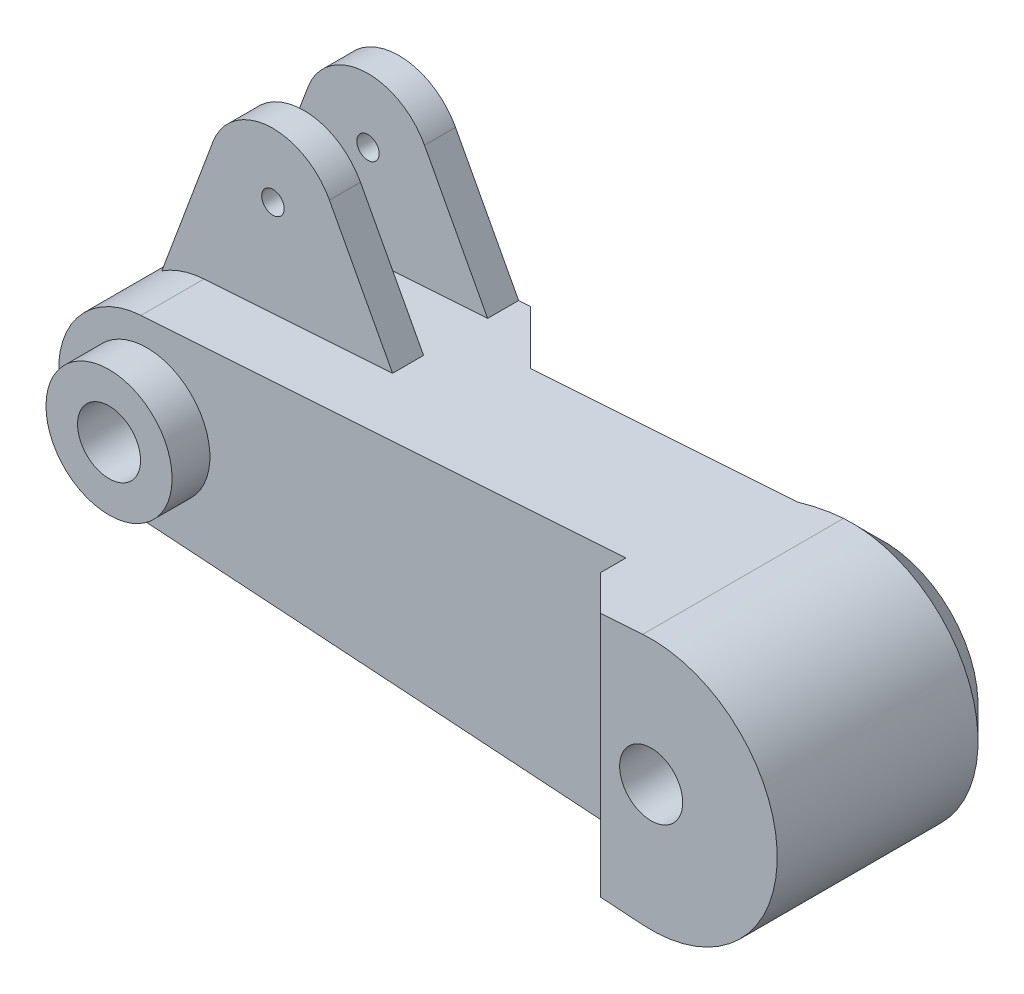
ISO-10303-21;
HEADER;
FILE_DESCRIPTION(('STEP AP214'),'2;1');
FILE_NAME('part.step','',(''),(''),'','','');
FILE_SCHEMA(('AUTOMOTIVE_DESIGN { 1 0 10303 214 1 1 1 1 }'));
ENDSEC;
DATA;
#1=APPLICATION_CONTEXT('core data for automotive mechanical design processes');
#2=APPLICATION_PROTOCOL_DEFINITION('international standard','automotive_design',2000,#1);
#3=PRODUCT_CONTEXT('',#1,'mechanical');
#4=PRODUCT('Part','Part','',(#3));
#5=PRODUCT_RELATED_PRODUCT_CATEGORY('part','',(#4));
#6=PRODUCT_DEFINITION_FORMATION('','',#4);
#7=PRODUCT_DEFINITION_CONTEXT('part definition',#1,'design');
#8=PRODUCT_DEFINITION('design','',#6,#7);
#9=PRODUCT_DEFINITION_SHAPE('','',#8);
#10=(LENGTH_UNIT() NAMED_UNIT(*) SI_UNIT(.MILLI.,.METRE.));
#11=(NAMED_UNIT(*) PLANE_ANGLE_UNIT() SI_UNIT($,.RADIAN.));
#12=(NAMED_UNIT(*) SI_UNIT($,.STERADIAN.) SOLID_ANGLE_UNIT());
#13=UNCERTAINTY_MEASURE_WITH_UNIT(LENGTH_MEASURE(1.E-05),#10,'distance_accuracy_value','');
#14=(GEOMETRIC_REPRESENTATION_CONTEXT(3) GLOBAL_UNCERTAINTY_ASSIGNED_CONTEXT((#13)) GLOBAL_UNIT_ASSIGNED_CONTEXT((#10,
#11,#12)) REPRESENTATION_CONTEXT('',''));
#15=CARTESIAN_POINT('',(0.,0.,0.));
#16=DIRECTION('',(0.,0.,1.));
#17=DIRECTION('',(1.,0.,0.));
#18=AXIS2_PLACEMENT_3D('',#15,#16,#17);
#19=CARTESIAN_POINT('',(-52.,-10.,15.));
#20=DIRECTION('',(0.,0.,-1.));
#21=DIRECTION('',(-1.,0.,0.));
#22=AXIS2_PLACEMENT_3D('',#19,#20,#21);
#23=PLANE('',#22);
#24=CARTESIAN_POINT('',(-45.,0.,15.));
#25=DIRECTION('',(0.,0.,-1.));
#26=DIRECTION('',(-1.,0.,0.));
#27=AXIS2_PLACEMENT_3D('',#24,#25,#26);
#28=CIRCLE('',#27,7.);
#29=CARTESIAN_POINT('',(-45.4666666666667,-6.98442712197802,15.));
#30=VERTEX_POINT('',#29);
#31=CARTESIAN_POINT('',(-45.4666666666667,6.98442712197802,15.));
#32=VERTEX_POINT('',#31);
#33=EDGE_CURVE('E194',#30,#32,#28,.T.);
#34=ORIENTED_EDGE('',*,*,#33,.F.);
#35=DIRECTION('',(-0.997775303139718,0.0666666666666667,0.));
#36=VECTOR('',#35,1.);
#37=CARTESIAN_POINT('',(-45.4666666666667,-6.98442712197802,15.));
#38=LINE('',#37,#36);
#39=CARTESIAN_POINT('',(-7.00000000000001,-9.55458939836917,15.));
#40=VERTEX_POINT('',#39);
#41=EDGE_CURVE('E177',#40,#30,#38,.T.);
#42=ORIENTED_EDGE('',*,*,#41,.F.);
#43=DIRECTION('',(0.,1.,0.));
#44=VECTOR('',#43,1.);
#45=CARTESIAN_POINT('',(-7.00000000000001,-10.,15.));
#46=LINE('',#45,#44);
#47=CARTESIAN_POINT('',(-7.00000000000001,9.55458939836917,15.));
#48=VERTEX_POINT('',#47);
#49=EDGE_CURVE('E191',#40,#48,#46,.T.);
#50=ORIENTED_EDGE('',*,*,#49,.T.);
#51=DIRECTION('',(0.997775303139718,0.0666666666666668,0.));
#52=VECTOR('',#51,1.);
#53=CARTESIAN_POINT('',(-45.4666666666667,6.98442712197802,15.));
#54=LINE('',#53,#52);
#55=EDGE_CURVE('E206',#32,#48,#54,.T.);
#56=ORIENTED_EDGE('',*,*,#55,.F.);
#57=EDGE_LOOP('',(#34,#42,#50,#56));
#58=FACE_BOUND('',#57,.T.);
#59=CARTESIAN_POINT('',(-45.,0.,15.));
#60=DIRECTION('',(0.,0.,-1.));
#61=DIRECTION('',(-1.,0.,0.));
#62=AXIS2_PLACEMENT_3D('',#59,#60,#61);
#63=CIRCLE('',#62,5.);
#64=CARTESIAN_POINT('',(-50.,0.,15.));
#65=VERTEX_POINT('',#64);
#66=EDGE_CURVE('E325',#65,#65,#63,.F.);
#67=ORIENTED_EDGE('',*,*,#66,.F.);
#68=EDGE_LOOP('',(#67));
#69=FACE_BOUND('',#68,.T.);
#70=ADVANCED_FACE('F40',(#58,#69),#23,.F.);
#71=CARTESIAN_POINT('',(-30.,-10.,4.572));
#72=DIRECTION('',(0.,0.,1.));
#73=DIRECTION('',(1.,0.,0.));
#74=AXIS2_PLACEMENT_3D('',#71,#72,#73);
#75=PLANE('',#74);
#76=DIRECTION('',(-0.997775303139718,-0.0666666666666668,0.));
#77=VECTOR('',#76,1.);
#78=CARTESIAN_POINT('',(-45.4666666666667,6.98442712197802,4.572));
#79=LINE('',#78,#77);
#80=CARTESIAN_POINT('',(-3.86110628018951,9.76431555681609,4.572));
#81=VERTEX_POINT('',#80);
#82=CARTESIAN_POINT('',(-24.9999999999999,8.35191380976327,4.572));
#83=VERTEX_POINT('',#82);
#84=EDGE_CURVE('E186',#81,#83,#79,.T.);
#85=ORIENTED_EDGE('',*,*,#84,.F.);
#86=CARTESIAN_POINT('',(0.,0.,4.572));
#87=DIRECTION('',(0.,0.,1.));
#88=DIRECTION('',(1.,0.,0.));
#89=AXIS2_PLACEMENT_3D('',#86,#87,#88);
#90=CIRCLE('',#89,10.5);
#91=CARTESIAN_POINT('',(-3.86110628018952,-9.76431555681609,4.572));
#92=VERTEX_POINT('',#91);
#93=EDGE_CURVE('E335',#81,#92,#90,.T.);
#94=ORIENTED_EDGE('',*,*,#93,.T.);
#95=DIRECTION('',(0.997775303139718,-0.0666666666666667,0.));
#96=VECTOR('',#95,1.);
#97=CARTESIAN_POINT('',(-45.4666666666667,-6.98442712197802,4.572));
#98=LINE('',#97,#96);
#99=CARTESIAN_POINT('',(-24.9999999999999,-8.35191380976327,4.572));
#100=VERTEX_POINT('',#99);
#101=EDGE_CURVE('E208',#100,#92,#98,.T.);
#102=ORIENTED_EDGE('',*,*,#101,.F.);
#103=DIRECTION('',(0.,1.,0.));
#104=VECTOR('',#103,1.);
#105=CARTESIAN_POINT('',(-24.9999999999999,8.01783725737273,4.572));
#106=LINE('',#105,#104);
#107=EDGE_CURVE('E312',#100,#83,#106,.T.);
#108=ORIENTED_EDGE('',*,*,#107,.T.);
#109=EDGE_LOOP('',(#85,#94,#102,#108));
#110=FACE_BOUND('',#109,.T.);
#111=ADVANCED_FACE('F378',(#110),#75,.F.);
#112=CARTESIAN_POINT('',(-30.5120222717425,7.98362633031455,10.));
#113=DIRECTION('',(-0.882521204850308,-0.470272604974562,0.));
#114=DIRECTION('',(0.470272604974562,-0.882521204850308,0.));
#115=AXIS2_PLACEMENT_3D('',#112,#113,#114);
#116=PLANE('',#115);
#117=DIRECTION('',(0.,0.,-1.));
#118=VECTOR('',#117,1.);
#119=CARTESIAN_POINT('',(-30.5120222717425,7.98362633031455,10.));
#120=LINE('',#119,#118);
#121=CARTESIAN_POINT('',(-30.5120222717425,7.98362633031455,10.));
#122=VERTEX_POINT('',#121);
#123=CARTESIAN_POINT('',(-30.5120222717425,7.98362633031455,7.54));
#124=VERTEX_POINT('',#123);
#125=EDGE_CURVE('E272',#122,#124,#120,.T.);
#126=ORIENTED_EDGE('',*,*,#125,.T.);
#127=DIRECTION('',(-0.470272604974562,0.882521204850308,0.));
#128=VECTOR('',#127,1.);
#129=CARTESIAN_POINT('',(-30.5120222717425,7.98362633031455,7.54));
#130=LINE('',#129,#128);
#131=CARTESIAN_POINT('',(-35.5167922793604,17.37565897351,7.54));
#132=VERTEX_POINT('',#131);
#133=EDGE_CURVE('E237',#124,#132,#130,.T.);
#134=ORIENTED_EDGE('',*,*,#133,.T.);
#135=DIRECTION('',(0.,0.,-1.));
#136=VECTOR('',#135,1.);
#137=CARTESIAN_POINT('',(-35.5167922793604,17.37565897351,10.));
#138=LINE('',#137,#136);
#139=CARTESIAN_POINT('',(-35.5167922793604,17.37565897351,10.));
#140=VERTEX_POINT('',#139);
#141=EDGE_CURVE('E268',#140,#132,#138,.T.);
#142=ORIENTED_EDGE('',*,*,#141,.F.);
#143=DIRECTION('',(-0.470272604974562,0.882521204850308,0.));
#144=VECTOR('',#143,1.);
#145=CARTESIAN_POINT('',(-30.5120222717425,7.98362633031455,10.));
#146=LINE('',#145,#144);
#147=EDGE_CURVE('E251',#122,#140,#146,.T.);
#148=ORIENTED_EDGE('',*,*,#147,.F.);
#149=EDGE_LOOP('',(#126,#134,#142,#148));
#150=FACE_BOUND('',#149,.T.);
#151=ADVANCED_FACE('F383',(#150),#116,.F.);
#152=CARTESIAN_POINT('',(-40.,14.9866741402392,10.));
#153=DIRECTION('',(0.,0.,-1.));
#154=DIRECTION('',(-1.,0.,0.));
#155=AXIS2_PLACEMENT_3D('',#152,#153,#154);
#156=CYLINDRICAL_SURFACE('',#155,5.08);
#157=ORIENTED_EDGE('',*,*,#141,.T.);
#158=CARTESIAN_POINT('',(-40.,14.9866741402392,7.54));
#159=DIRECTION('',(0.,0.,1.));
#160=DIRECTION('',(0.,-1.,0.));
#161=AXIS2_PLACEMENT_3D('',#158,#159,#160);
#162=CIRCLE('',#161,5.08);
#163=CARTESIAN_POINT('',(-44.76117966084,16.7579923604365,7.54));
#164=VERTEX_POINT('',#163);
#165=EDGE_CURVE('E234',#132,#164,#162,.T.);
#166=ORIENTED_EDGE('',*,*,#165,.T.);
#167=DIRECTION('',(0.,0.,-1.));
#168=VECTOR('',#167,1.);
#169=CARTESIAN_POINT('',(-44.76117966084,16.7579923604365,10.));
#170=LINE('',#169,#168);
#171=CARTESIAN_POINT('',(-44.76117966084,16.7579923604365,10.));
#172=VERTEX_POINT('',#171);
#173=EDGE_CURVE('E264',#172,#164,#170,.T.);
#174=ORIENTED_EDGE('',*,*,#173,.F.);
#175=CARTESIAN_POINT('',(-40.,14.9866741402392,10.));
#176=DIRECTION('',(0.,0.,1.));
#177=DIRECTION('',(1.,0.,0.));
#178=AXIS2_PLACEMENT_3D('',#175,#176,#177);
#179=CIRCLE('',#178,5.08);
#180=EDGE_CURVE('E253',#140,#172,#179,.T.);
#181=ORIENTED_EDGE('',*,*,#180,.F.);
#182=EDGE_LOOP('',(#157,#166,#174,#181));
#183=FACE_BOUND('',#182,.T.);
#184=ADVANCED_FACE('F353',(#183),#156,.T.);
#185=CARTESIAN_POINT('',(-45.,0.,20.));
#186=DIRECTION('',(0.,0.,-1.));
#187=DIRECTION('',(-1.,0.,0.));
#188=AXIS2_PLACEMENT_3D('',#185,#186,#187);
#189=CYLINDRICAL_SURFACE('',#188,7.);
#190=DIRECTION('',(0.,0.,-1.));
#191=VECTOR('',#190,1.);
#192=CARTESIAN_POINT('',(-45.4666666666667,-6.98442712197802,20.));
#193=LINE('',#192,#191);
#194=CARTESIAN_POINT('',(-45.4666666666667,-6.98442712197802,0.));
#195=VERTEX_POINT('',#194);
#196=EDGE_CURVE('E301',#30,#195,#193,.T.);
#197=ORIENTED_EDGE('',*,*,#196,.F.);
#198=ORIENTED_EDGE('',*,*,#33,.T.);
#199=DIRECTION('',(0.,0.,-1.));
#200=VECTOR('',#199,1.);
#201=CARTESIAN_POINT('',(-45.4666666666667,6.98442712197802,20.));
#202=LINE('',#201,#200);
#203=CARTESIAN_POINT('',(-45.4666666666667,6.98442712197802,10.));
#204=VERTEX_POINT('',#203);
#205=EDGE_CURVE('E292',#32,#204,#202,.T.);
#206=ORIENTED_EDGE('',*,*,#205,.T.);
#207=CARTESIAN_POINT('',(-45.,0.,10.));
#208=DIRECTION('',(0.,0.,-1.));
#209=DIRECTION('',(1.,0.,0.));
#210=AXIS2_PLACEMENT_3D('',#207,#208,#209);
#211=CIRCLE('',#210,7.);
#212=CARTESIAN_POINT('',(-48.8113471061586,5.87142514525872,10.));
#213=VERTEX_POINT('',#212);
#214=EDGE_CURVE('E244',#213,#204,#211,.T.);
#215=ORIENTED_EDGE('',*,*,#214,.F.);
#216=DIRECTION('',(0.,0.,-1.));
#217=VECTOR('',#216,1.);
#218=CARTESIAN_POINT('',(-48.8113471061586,5.87142514525872,10.));
#219=LINE('',#218,#217);
#220=CARTESIAN_POINT('',(-48.8113471061586,5.87142514525872,0.));
#221=VERTEX_POINT('',#220);
#222=EDGE_CURVE('E275',#213,#221,#219,.T.);
#223=ORIENTED_EDGE('',*,*,#222,.T.);
#224=CARTESIAN_POINT('',(-45.,0.,0.));
#225=DIRECTION('',(0.,0.,1.));
#226=DIRECTION('',(1.,0.,0.));
#227=AXIS2_PLACEMENT_3D('',#224,#225,#226);
#228=CIRCLE('',#227,7.);
#229=EDGE_CURVE('E281',#221,#195,#228,.T.);
#230=ORIENTED_EDGE('',*,*,#229,.T.);
#231=EDGE_LOOP('',(#197,#198,#206,#215,#223,#230));
#232=FACE_BOUND('',#231,.T.);
#233=ADVANCED_FACE('F350',(#232),#189,.T.);
#234=CARTESIAN_POINT('',(-45.4666666666667,6.98442712197802,20.));
#235=DIRECTION('',(0.0666666666666668,-0.997775303139718,0.));
#236=DIRECTION('',(0.997775303139718,0.0666666666666668,0.));
#237=AXIS2_PLACEMENT_3D('',#234,#235,#236);
#238=PLANE('',#237);
#239=DIRECTION('',(0.,0.,1.));
#240=VECTOR('',#239,1.);
#241=CARTESIAN_POINT('',(-7.00000000000001,9.55458939836917,20.));
#242=LINE('',#241,#240);
#243=CARTESIAN_POINT('',(-7.00000000000001,9.55458939836917,17.));
#244=VERTEX_POINT('',#243);
#245=EDGE_CURVE('E185',#48,#244,#242,.T.);
#246=ORIENTED_EDGE('',*,*,#245,.T.);
#247=DIRECTION('',(0.706318918233046,0.0471929178183011,0.706318918233042));
#248=VECTOR('',#247,1.);
#249=CARTESIAN_POINT('',(-7.65181803000214,9.51103797431936,16.3481819699979));
#250=LINE('',#249,#248);
#251=CARTESIAN_POINT('',(-4.,9.75503532980349,20.));
#252=VERTEX_POINT('',#251);
#253=EDGE_CURVE('E330',#244,#252,#250,.T.);
#254=ORIENTED_EDGE('',*,*,#253,.T.);
#255=DIRECTION('',(-0.997775303139718,-0.0666666666666668,0.));
#256=VECTOR('',#255,1.);
#257=CARTESIAN_POINT('',(-45.4666666666667,6.98442712197802,20.));
#258=LINE('',#257,#256);
#259=CARTESIAN_POINT('',(-0.666666666666665,9.97775303139718,20.));
#260=VERTEX_POINT('',#259);
#261=EDGE_CURVE('E289',#260,#252,#258,.T.);
#262=ORIENTED_EDGE('',*,*,#261,.F.);
#263=DIRECTION('',(0.,0.,-1.));
#264=VECTOR('',#263,1.);
#265=CARTESIAN_POINT('',(-0.666666666666665,9.97775303139718,20.));
#266=LINE('',#265,#264);
#267=CARTESIAN_POINT('',(-0.666666666666665,9.97775303139718,4.07200000000002));
#268=VERTEX_POINT('',#267);
#269=EDGE_CURVE('E61',#260,#268,#266,.T.);
#270=ORIENTED_EDGE('',*,*,#269,.T.);
#271=CARTESIAN_POINT('',(-0.666666666666665,9.97775303139718,4.07200000000002));
#272=CARTESIAN_POINT('',(-0.802311553116537,9.96868987619427,4.07199227718591));
#273=CARTESIAN_POINT('',(-0.93794176782531,9.95962770128829,4.07477330544112));
#274=CARTESIAN_POINT('',(-1.20896713377436,9.94151905731496,4.08584129678912));
#275=CARTESIAN_POINT('',(-1.3443623041731,9.93247258696753,4.09412778775187));
#276=CARTESIAN_POINT('',(-1.74837955702386,9.9054780487798,4.12701332720823));
#277=CARTESIAN_POINT('',(-2.01638495367758,9.88757118499257,4.15964033469788));
#278=CARTESIAN_POINT('',(-2.54901139088242,9.85198358422188,4.24498320746917));
#279=CARTESIAN_POINT('',(-2.81363397676884,9.83430274398636,4.29768953452867));
#280=CARTESIAN_POINT('',(-3.20806670748223,9.80794859862102,4.39047792022871));
#281=CARTESIAN_POINT('',(-3.33950015565084,9.79916683197442,4.42381086255465));
#282=CARTESIAN_POINT('',(-3.60119329245134,9.78168172378911,4.49476147246656));
#283=CARTESIAN_POINT('',(-3.73145313487216,9.77297837197493,4.53237856957991));
#284=CARTESIAN_POINT('',(-3.86110628018951,9.76431555681609,4.572));
#285=B_SPLINE_CURVE_WITH_KNOTS('',3,(#271,#272,#273,#274,#275,#276,#277,#278,#279,#280,#281,
#282,#283,#284),.UNSPECIFIED.,.F.,.F.,(4,2,2,2,2,2,4),(0.,0.407785235213258,0.815535504643655,
1.62638482378702,2.43684944679052,2.84442266241533,3.25194166942249),.UNSPECIFIED.);
#286=EDGE_CURVE('E11',#268,#81,#285,.T.);
#287=ORIENTED_EDGE('',*,*,#286,.T.);
#288=ORIENTED_EDGE('',*,*,#84,.T.);
#289=DIRECTION('',(0.706318918233048,0.0471929178183012,0.70631891823304));
#290=VECTOR('',#289,1.);
#291=CARTESIAN_POINT('',(-27.5593051224945,8.18091304339559,2.01269487750544));
#292=LINE('',#291,#290);
#293=CARTESIAN_POINT('',(-29.572,8.04643421025736,0.));
#294=VERTEX_POINT('',#293);
#295=EDGE_CURVE('E317',#83,#294,#292,.F.);
#296=ORIENTED_EDGE('',*,*,#295,.T.);
#297=DIRECTION('',(-0.997775303139718,-0.0666666666666668,0.));
#298=VECTOR('',#297,1.);
#299=CARTESIAN_POINT('',(-45.4666666666667,6.98442712197802,0.));
#300=LINE('',#299,#298);
#301=CARTESIAN_POINT('',(-30.5120222717425,7.98362633031455,0.));
#302=VERTEX_POINT('',#301);
#303=EDGE_CURVE('E287',#294,#302,#300,.T.);
#304=ORIENTED_EDGE('',*,*,#303,.T.);
#305=CARTESIAN_POINT('',(-30.5120222717425,7.98362633031455,2.46));
#306=VERTEX_POINT('',#305);
#307=EDGE_CURVE('E271',#306,#302,#120,.T.);
#308=ORIENTED_EDGE('',*,*,#307,.F.);
#309=DIRECTION('',(0.997775303139718,0.0666666666666668,0.));
#310=VECTOR('',#309,1.);
#311=CARTESIAN_POINT('',(-53.100739090982,6.47435420273504,2.46));
#312=LINE('',#311,#310);
#313=CARTESIAN_POINT('',(-48.4719777282574,6.78362633031454,2.46));
#314=VERTEX_POINT('',#313);
#315=EDGE_CURVE('E224',#314,#306,#312,.T.);
#316=ORIENTED_EDGE('',*,*,#315,.F.);
#317=DIRECTION('',(0.,0.,-1.));
#318=VECTOR('',#317,1.);
#319=CARTESIAN_POINT('',(-48.4719777282574,6.78362633031454,10.));
#320=LINE('',#319,#318);
#321=CARTESIAN_POINT('',(-48.4719777282574,6.78362633031454,7.54));
#322=VERTEX_POINT('',#321);
#323=EDGE_CURVE('E303',#322,#314,#320,.T.);
#324=ORIENTED_EDGE('',*,*,#323,.F.);
#325=DIRECTION('',(0.997775303139718,0.0666666666666668,0.));
#326=VECTOR('',#325,1.);
#327=CARTESIAN_POINT('',(-53.100739090982,6.47435420273504,7.54));
#328=LINE('',#327,#326);
#329=EDGE_CURVE('E223',#322,#124,#328,.T.);
#330=ORIENTED_EDGE('',*,*,#329,.T.);
#331=ORIENTED_EDGE('',*,*,#125,.F.);
#332=DIRECTION('',(0.997775303139718,0.0666666666666665,0.));
#333=VECTOR('',#332,1.);
#334=CARTESIAN_POINT('',(-45.4666666666667,6.98442712197803,10.));
#335=LINE('',#334,#333);
#336=EDGE_CURVE('E248',#204,#122,#335,.T.);
#337=ORIENTED_EDGE('',*,*,#336,.F.);
#338=ORIENTED_EDGE('',*,*,#205,.F.);
#339=ORIENTED_EDGE('',*,*,#55,.T.);
#340=EDGE_LOOP('',(#246,#254,#262,#270,#287,#288,#296,#304,#308,#316,#324,#330,#331,#337,#338,#339));
#341=FACE_BOUND('',#340,.T.);
#342=ADVANCED_FACE('F349',(#341),#238,.F.);
#343=CARTESIAN_POINT('',(-45.4666666666667,-6.98442712197802,20.));
#344=DIRECTION('',(0.0666666666666667,0.997775303139718,0.));
#345=DIRECTION('',(-0.997775303139718,0.0666666666666667,0.));
#346=AXIS2_PLACEMENT_3D('',#343,#344,#345);
#347=PLANE('',#346);
#348=DIRECTION('',(0.997775303139718,-0.0666666666666667,0.));
#349=VECTOR('',#348,1.);
#350=CARTESIAN_POINT('',(-45.4666666666667,-6.98442712197802,20.));
#351=LINE('',#350,#349);
#352=CARTESIAN_POINT('',(-4.,-9.75503532980349,20.));
#353=VERTEX_POINT('',#352);
#354=CARTESIAN_POINT('',(-0.666666666666666,-9.97775303139718,20.));
#355=VERTEX_POINT('',#354);
#356=EDGE_CURVE('E284',#353,#355,#351,.T.);
#357=ORIENTED_EDGE('',*,*,#356,.F.);
#358=DIRECTION('',(-0.706318918233046,0.047192917818301,-0.706318918233042));
#359=VECTOR('',#358,1.);
#360=CARTESIAN_POINT('',(-6.98515301676847,-9.55558140416345,17.0148469832315));
#361=LINE('',#360,#359);
#362=CARTESIAN_POINT('',(-7.00000000000001,-9.55458939836917,17.));
#363=VERTEX_POINT('',#362);
#364=EDGE_CURVE('E180',#353,#363,#361,.T.);
#365=ORIENTED_EDGE('',*,*,#364,.T.);
#366=DIRECTION('',(0.,0.,-1.));
#367=VECTOR('',#366,1.);
#368=CARTESIAN_POINT('',(-7.00000000000001,-9.55458939836917,20.));
#369=LINE('',#368,#367);
#370=EDGE_CURVE('E173',#363,#40,#369,.T.);
#371=ORIENTED_EDGE('',*,*,#370,.T.);
#372=ORIENTED_EDGE('',*,*,#41,.T.);
#373=ORIENTED_EDGE('',*,*,#196,.T.);
#374=DIRECTION('',(0.997775303139718,-0.0666666666666667,0.));
#375=VECTOR('',#374,1.);
#376=CARTESIAN_POINT('',(-45.4666666666667,-6.98442712197802,0.));
#377=LINE('',#376,#375);
#378=CARTESIAN_POINT('',(-29.572,-8.04643421025736,0.));
#379=VERTEX_POINT('',#378);
#380=EDGE_CURVE('E295',#195,#379,#377,.T.);
#381=ORIENTED_EDGE('',*,*,#380,.T.);
#382=DIRECTION('',(-0.706318918233048,0.0471929178183011,-0.70631891823304));
#383=VECTOR('',#382,1.);
#384=CARTESIAN_POINT('',(-27.5593051224945,-8.18091304339559,2.01269487750544));
#385=LINE('',#384,#383);
#386=EDGE_CURVE('E323',#379,#100,#385,.F.);
#387=ORIENTED_EDGE('',*,*,#386,.T.);
#388=ORIENTED_EDGE('',*,*,#101,.T.);
#389=CARTESIAN_POINT('',(-3.86110628018952,-9.76431555681609,4.572));
#390=CARTESIAN_POINT('',(-3.73145313487217,-9.77297837197493,4.53237856957991));
#391=CARTESIAN_POINT('',(-3.60119329245134,-9.78168172378911,4.49476147246656));
#392=CARTESIAN_POINT('',(-3.33950015565085,-9.79916683197442,4.42381086255465));
#393=CARTESIAN_POINT('',(-3.20806670748223,-9.80794859862102,4.39047792022871));
#394=CARTESIAN_POINT('',(-2.81363397676884,-9.83430274398636,4.29768953452867));
#395=CARTESIAN_POINT('',(-2.54901139088243,-9.85198358422188,4.24498320746917));
#396=CARTESIAN_POINT('',(-2.01638495367758,-9.88757118499257,4.15964033469787));
#397=CARTESIAN_POINT('',(-1.74837955702386,-9.90547804877979,4.12701332720822));
#398=CARTESIAN_POINT('',(-1.3443623041731,-9.93247258696753,4.09412778775186));
#399=CARTESIAN_POINT('',(-1.20896713377436,-9.94151905731496,4.08584129678911));
#400=CARTESIAN_POINT('',(-0.937941767825311,-9.95962770128828,4.07477330544111));
#401=CARTESIAN_POINT('',(-0.802311553116538,-9.96868987619426,4.07199227718591));
#402=CARTESIAN_POINT('',(-0.666666666666665,-9.97775303139718,4.07200000000002));
#403=B_SPLINE_CURVE_WITH_KNOTS('',3,(#389,#390,#391,#392,#393,#394,#395,#396,#397,#398,#399,
#400,#401,#402),.UNSPECIFIED.,.F.,.F.,(4,2,2,2,2,2,4),(0.,0.407519007007159,0.815092222631966,
1.62555684563547,2.43640616477884,2.84415643420924,3.2519416694225),.UNSPECIFIED.);
#404=CARTESIAN_POINT('',(-0.666666666666666,-9.97775303139718,4.07200000000002));
#405=VERTEX_POINT('',#404);
#406=EDGE_CURVE('E338',#92,#405,#403,.T.);
#407=ORIENTED_EDGE('',*,*,#406,.T.);
#408=DIRECTION('',(0.,0.,-1.));
#409=VECTOR('',#408,1.);
#410=CARTESIAN_POINT('',(-0.666666666666666,-9.97775303139718,20.));
#411=LINE('',#410,#409);
#412=EDGE_CURVE('E68',#355,#405,#411,.T.);
#413=ORIENTED_EDGE('',*,*,#412,.F.);
#414=EDGE_LOOP('',(#357,#365,#371,#372,#373,#381,#387,#388,#407,#413));
#415=FACE_BOUND('',#414,.T.);
#416=ADVANCED_FACE('F176',(#415),#347,.F.);
#417=CARTESIAN_POINT('',(0.,0.,20.));
#418=DIRECTION('',(0.,0.,-1.));
#419=DIRECTION('',(-1.,0.,0.));
#420=AXIS2_PLACEMENT_3D('',#417,#418,#419);
#421=CYLINDRICAL_SURFACE('',#420,10.);
#422=ORIENTED_EDGE('',*,*,#412,.T.);
#423=CARTESIAN_POINT('',(0.,0.,4.07200000000002));
#424=DIRECTION('',(0.,0.,1.));
#425=DIRECTION('',(1.,0.,0.));
#426=AXIS2_PLACEMENT_3D('',#423,#424,#425);
#427=CIRCLE('',#426,10.);
#428=EDGE_CURVE('E55',#405,#268,#427,.T.);
#429=ORIENTED_EDGE('',*,*,#428,.T.);
#430=ORIENTED_EDGE('',*,*,#269,.F.);
#431=CARTESIAN_POINT('',(0.,0.,20.));
#432=DIRECTION('',(0.,0.,1.));
#433=DIRECTION('',(1.,0.,0.));
#434=AXIS2_PLACEMENT_3D('',#431,#432,#433);
#435=CIRCLE('',#434,10.);
#436=EDGE_CURVE('E286',#355,#260,#435,.T.);
#437=ORIENTED_EDGE('',*,*,#436,.F.);
#438=EDGE_LOOP('',(#422,#429,#430,#437));
#439=FACE_BOUND('',#438,.T.);
#440=ADVANCED_FACE('F348',(#439),#421,.T.);
#441=CARTESIAN_POINT('',(-45.,0.,20.));
#442=DIRECTION('',(0.,0.,1.));
#443=DIRECTION('',(1.,0.,0.));
#444=AXIS2_PLACEMENT_3D('',#441,#442,#443);
#445=PLANE('',#444);
#446=ORIENTED_EDGE('',*,*,#261,.T.);
#447=DIRECTION('',(0.,-1.,0.));
#448=VECTOR('',#447,1.);
#449=CARTESIAN_POINT('',(-3.99999999999999,-9.55458939836917,20.));
#450=LINE('',#449,#448);
#451=EDGE_CURVE('E332',#252,#353,#450,.T.);
#452=ORIENTED_EDGE('',*,*,#451,.T.);
#453=ORIENTED_EDGE('',*,*,#356,.T.);
#454=ORIENTED_EDGE('',*,*,#436,.T.);
#455=EDGE_LOOP('',(#446,#452,#453,#454));
#456=FACE_BOUND('',#455,.T.);
#457=CARTESIAN_POINT('',(0.,0.,20.));
#458=DIRECTION('',(0.,0.,1.));
#459=DIRECTION('',(1.,0.,0.));
#460=AXIS2_PLACEMENT_3D('',#457,#458,#459);
#461=CIRCLE('',#460,2.5);
#462=CARTESIAN_POINT('',(2.5,0.,20.));
#463=VERTEX_POINT('',#462);
#464=EDGE_CURVE('E277',#463,#463,#461,.T.);
#465=ORIENTED_EDGE('',*,*,#464,.F.);
#466=EDGE_LOOP('',(#465));
#467=FACE_BOUND('',#466,.T.);
#468=ADVANCED_FACE('F426',(#456,#467),#445,.T.);
#469=CARTESIAN_POINT('',(-45.,0.,0.));
#470=DIRECTION('',(0.,0.,1.));
#471=DIRECTION('',(1.,0.,0.));
#472=AXIS2_PLACEMENT_3D('',#469,#470,#471);
#473=PLANE('',#472);
#474=CARTESIAN_POINT('',(-40.,14.9866741402392,0.));
#475=DIRECTION('',(0.,0.,1.));
#476=DIRECTION('',(1.,0.,0.));
#477=AXIS2_PLACEMENT_3D('',#474,#475,#476);
#478=CIRCLE('',#477,0.889000000000003);
#479=CARTESIAN_POINT('',(-39.111,14.9866741402392,0.));
#480=VERTEX_POINT('',#479);
#481=EDGE_CURVE('E213',#480,#480,#478,.T.);
#482=ORIENTED_EDGE('',*,*,#481,.T.);
#483=EDGE_LOOP('',(#482));
#484=FACE_BOUND('',#483,.T.);
#485=ORIENTED_EDGE('',*,*,#303,.F.);
#486=DIRECTION('',(0.,1.,0.));
#487=VECTOR('',#486,1.);
#488=CARTESIAN_POINT('',(-29.572,0.,0.));
#489=LINE('',#488,#487);
#490=EDGE_CURVE('E320',#294,#379,#489,.F.);
#491=ORIENTED_EDGE('',*,*,#490,.T.);
#492=ORIENTED_EDGE('',*,*,#380,.F.);
#493=ORIENTED_EDGE('',*,*,#229,.F.);
#494=DIRECTION('',(-0.348684689015221,-0.937240090716546,0.));
#495=VECTOR('',#494,1.);
#496=CARTESIAN_POINT('',(-44.76117966084,16.7579923604365,0.));
#497=LINE('',#496,#495);
#498=CARTESIAN_POINT('',(-44.76117966084,16.7579923604365,0.));
#499=VERTEX_POINT('',#498);
#500=EDGE_CURVE('E245',#499,#221,#497,.T.);
#501=ORIENTED_EDGE('',*,*,#500,.F.);
#502=CARTESIAN_POINT('',(-40.,14.9866741402392,0.));
#503=DIRECTION('',(0.,0.,1.));
#504=DIRECTION('',(1.,0.,0.));
#505=AXIS2_PLACEMENT_3D('',#502,#503,#504);
#506=CIRCLE('',#505,5.08);
#507=CARTESIAN_POINT('',(-35.5167922793604,17.37565897351,0.));
#508=VERTEX_POINT('',#507);
#509=EDGE_CURVE('E259',#508,#499,#506,.T.);
#510=ORIENTED_EDGE('',*,*,#509,.F.);
#511=DIRECTION('',(-0.470272604974562,0.882521204850308,0.));
#512=VECTOR('',#511,1.);
#513=CARTESIAN_POINT('',(-30.5120222717425,7.98362633031455,0.));
#514=LINE('',#513,#512);
#515=EDGE_CURVE('E240',#302,#508,#514,.T.);
#516=ORIENTED_EDGE('',*,*,#515,.F.);
#517=EDGE_LOOP('',(#485,#491,#492,#493,#501,#510,#516));
#518=FACE_BOUND('',#517,.T.);
#519=CARTESIAN_POINT('',(-45.,0.,0.));
#520=DIRECTION('',(0.,0.,1.));
#521=DIRECTION('',(1.,0.,0.));
#522=AXIS2_PLACEMENT_3D('',#519,#520,#521);
#523=CIRCLE('',#522,2.49999999999999);
#524=CARTESIAN_POINT('',(-42.5,0.,0.));
#525=VERTEX_POINT('',#524);
#526=EDGE_CURVE('E278',#525,#525,#523,.T.);
#527=ORIENTED_EDGE('',*,*,#526,.T.);
#528=EDGE_LOOP('',(#527));
#529=FACE_BOUND('',#528,.T.);
#530=ADVANCED_FACE('F424',(#484,#518,#529),#473,.F.);
#531=CARTESIAN_POINT('',(0.,0.,0.));
#532=DIRECTION('',(0.,0.,1.));
#533=DIRECTION('',(1.,0.,0.));
#534=AXIS2_PLACEMENT_3D('',#531,#532,#533);
#535=CYLINDRICAL_SURFACE('',#534,2.5);
#536=ORIENTED_EDGE('',*,*,#464,.T.);
#537=EDGE_LOOP('',(#536));
#538=FACE_BOUND('',#537,.T.);
#539=CARTESIAN_POINT('',(0.,0.,1.572));
#540=DIRECTION('',(0.,0.,-1.));
#541=DIRECTION('',(-1.,0.,0.));
#542=AXIS2_PLACEMENT_3D('',#539,#540,#541);
#543=CIRCLE('',#542,2.5);
#544=CARTESIAN_POINT('',(-2.5,0.,1.572));
#545=VERTEX_POINT('',#544);
#546=EDGE_CURVE('E201',#545,#545,#543,.T.);
#547=ORIENTED_EDGE('',*,*,#546,.T.);
#548=EDGE_LOOP('',(#547));
#549=FACE_BOUND('',#548,.T.);
#550=ADVANCED_FACE('F420',(#538,#549),#535,.F.);
#551=CARTESIAN_POINT('',(-45.,0.,0.));
#552=DIRECTION('',(0.,0.,1.));
#553=DIRECTION('',(1.,0.,0.));
#554=AXIS2_PLACEMENT_3D('',#551,#552,#553);
#555=CYLINDRICAL_SURFACE('',#554,2.49999999999999);
#556=ORIENTED_EDGE('',*,*,#526,.F.);
#557=EDGE_LOOP('',(#556));
#558=FACE_BOUND('',#557,.T.);
#559=CARTESIAN_POINT('',(-45.,0.,18.));
#560=DIRECTION('',(0.,0.,1.));
#561=DIRECTION('',(1.,0.,0.));
#562=AXIS2_PLACEMENT_3D('',#559,#560,#561);
#563=CIRCLE('',#562,2.49999999999999);
#564=CARTESIAN_POINT('',(-42.5,0.,18.));
#565=VERTEX_POINT('',#564);
#566=EDGE_CURVE('E462',#565,#565,#563,.T.);
#567=ORIENTED_EDGE('',*,*,#566,.T.);
#568=EDGE_LOOP('',(#567));
#569=FACE_BOUND('',#568,.T.);
#570=ADVANCED_FACE('F416',(#558,#569),#555,.F.);
#571=CARTESIAN_POINT('',(-35.5167922793604,17.37565897351,2.46));
#572=VERTEX_POINT('',#571);
#573=EDGE_CURVE('E267',#572,#508,#138,.T.);
#574=ORIENTED_EDGE('',*,*,#573,.F.);
#575=DIRECTION('',(0.470272604974562,-0.882521204850308,0.));
#576=VECTOR('',#575,1.);
#577=CARTESIAN_POINT('',(-30.5120222717425,7.98362633031455,2.46));
#578=LINE('',#577,#576);
#579=EDGE_CURVE('E231',#572,#306,#578,.T.);
#580=ORIENTED_EDGE('',*,*,#579,.T.);
#581=ORIENTED_EDGE('',*,*,#307,.T.);
#582=ORIENTED_EDGE('',*,*,#515,.T.);
#583=EDGE_LOOP('',(#574,#580,#581,#582));
#584=FACE_BOUND('',#583,.T.);
#585=ADVANCED_FACE('F412',(#584),#116,.F.);
#586=CARTESIAN_POINT('',(-44.76117966084,16.7579923604365,2.46));
#587=VERTEX_POINT('',#586);
#588=EDGE_CURVE('E256',#587,#499,#170,.T.);
#589=ORIENTED_EDGE('',*,*,#588,.F.);
#590=CARTESIAN_POINT('',(-40.,14.9866741402392,2.46));
#591=DIRECTION('',(0.,0.,-1.));
#592=DIRECTION('',(0.,1.,0.));
#593=AXIS2_PLACEMENT_3D('',#590,#591,#592);
#594=CIRCLE('',#593,5.08);
#595=EDGE_CURVE('E226',#587,#572,#594,.T.);
#596=ORIENTED_EDGE('',*,*,#595,.T.);
#597=ORIENTED_EDGE('',*,*,#573,.T.);
#598=ORIENTED_EDGE('',*,*,#509,.T.);
#599=EDGE_LOOP('',(#589,#596,#597,#598));
#600=FACE_BOUND('',#599,.T.);
#601=ADVANCED_FACE('F408',(#600),#156,.T.);
#602=CARTESIAN_POINT('',(-44.76117966084,16.7579923604365,10.));
#603=DIRECTION('',(0.937240090716545,-0.348684689015221,0.));
#604=DIRECTION('',(0.348684689015221,0.937240090716546,0.));
#605=AXIS2_PLACEMENT_3D('',#602,#603,#604);
#606=PLANE('',#605);
#607=ORIENTED_EDGE('',*,*,#173,.T.);
#608=DIRECTION('',(-0.348684689015221,-0.937240090716546,0.));
#609=VECTOR('',#608,1.);
#610=CARTESIAN_POINT('',(-44.76117966084,16.7579923604365,7.54));
#611=LINE('',#610,#609);
#612=EDGE_CURVE('E309',#164,#322,#611,.T.);
#613=ORIENTED_EDGE('',*,*,#612,.T.);
#614=ORIENTED_EDGE('',*,*,#323,.T.);
#615=DIRECTION('',(0.348684689015221,0.937240090716546,0.));
#616=VECTOR('',#615,1.);
#617=CARTESIAN_POINT('',(-44.76117966084,16.7579923604365,2.46));
#618=LINE('',#617,#616);
#619=EDGE_CURVE('E306',#314,#587,#618,.T.);
#620=ORIENTED_EDGE('',*,*,#619,.T.);
#621=ORIENTED_EDGE('',*,*,#588,.T.);
#622=ORIENTED_EDGE('',*,*,#500,.T.);
#623=ORIENTED_EDGE('',*,*,#222,.F.);
#624=DIRECTION('',(-0.348684689015224,-0.937240090716545,0.));
#625=VECTOR('',#624,1.);
#626=CARTESIAN_POINT('',(-48.4719777282574,6.78362633031454,10.));
#627=LINE('',#626,#625);
#628=EDGE_CURVE('E241',#172,#213,#627,.T.);
#629=ORIENTED_EDGE('',*,*,#628,.F.);
#630=EDGE_LOOP('',(#607,#613,#614,#620,#621,#622,#623,#629));
#631=FACE_BOUND('',#630,.T.);
#632=ADVANCED_FACE('F404',(#631),#606,.F.);
#633=CARTESIAN_POINT('',(-45.,0.,10.));
#634=DIRECTION('',(0.,0.,1.));
#635=DIRECTION('',(1.,0.,0.));
#636=AXIS2_PLACEMENT_3D('',#633,#634,#635);
#637=PLANE('',#636);
#638=CARTESIAN_POINT('',(-40.,14.9866741402392,10.));
#639=DIRECTION('',(0.,0.,1.));
#640=DIRECTION('',(1.,0.,0.));
#641=AXIS2_PLACEMENT_3D('',#638,#639,#640);
#642=CIRCLE('',#641,0.889000000000003);
#643=CARTESIAN_POINT('',(-39.111,14.9866741402392,10.));
#644=VERTEX_POINT('',#643);
#645=EDGE_CURVE('E220',#644,#644,#642,.T.);
#646=ORIENTED_EDGE('',*,*,#645,.F.);
#647=EDGE_LOOP('',(#646));
#648=FACE_BOUND('',#647,.T.);
#649=ORIENTED_EDGE('',*,*,#628,.T.);
#650=ORIENTED_EDGE('',*,*,#214,.T.);
#651=ORIENTED_EDGE('',*,*,#336,.T.);
#652=ORIENTED_EDGE('',*,*,#147,.T.);
#653=ORIENTED_EDGE('',*,*,#180,.T.);
#654=EDGE_LOOP('',(#649,#650,#651,#652,#653));
#655=FACE_BOUND('',#654,.T.);
#656=ADVANCED_FACE('F400',(#648,#655),#637,.T.);
#657=CARTESIAN_POINT('',(-53.100739090982,6.47435420273504,7.54));
#658=DIRECTION('',(0.,0.,1.));
#659=DIRECTION('',(0.,-1.,0.));
#660=AXIS2_PLACEMENT_3D('',#657,#658,#659);
#661=PLANE('',#660);
#662=CARTESIAN_POINT('',(-40.,14.9866741402392,7.54));
#663=DIRECTION('',(0.,0.,1.));
#664=DIRECTION('',(0.,-1.,0.));
#665=AXIS2_PLACEMENT_3D('',#662,#663,#664);
#666=CIRCLE('',#665,0.889000000000003);
#667=CARTESIAN_POINT('',(-40.,14.0976741402392,7.54));
#668=VERTEX_POINT('',#667);
#669=EDGE_CURVE('E217',#668,#668,#666,.T.);
#670=ORIENTED_EDGE('',*,*,#669,.T.);
#671=EDGE_LOOP('',(#670));
#672=FACE_BOUND('',#671,.T.);
#673=ORIENTED_EDGE('',*,*,#329,.F.);
#674=ORIENTED_EDGE('',*,*,#612,.F.);
#675=ORIENTED_EDGE('',*,*,#165,.F.);
#676=ORIENTED_EDGE('',*,*,#133,.F.);
#677=EDGE_LOOP('',(#673,#674,#675,#676));
#678=FACE_BOUND('',#677,.T.);
#679=ADVANCED_FACE('F396',(#672,#678),#661,.F.);
#680=CARTESIAN_POINT('',(-53.100739090982,6.47435420273504,2.46));
#681=DIRECTION('',(0.,0.,-1.));
#682=DIRECTION('',(0.,1.,0.));
#683=AXIS2_PLACEMENT_3D('',#680,#681,#682);
#684=PLANE('',#683);
#685=CARTESIAN_POINT('',(-40.,14.9866741402392,2.46));
#686=DIRECTION('',(0.,0.,-1.));
#687=DIRECTION('',(0.,1.,0.));
#688=AXIS2_PLACEMENT_3D('',#685,#686,#687);
#689=CIRCLE('',#688,0.889000000000003);
#690=CARTESIAN_POINT('',(-40.,15.8756741402392,2.46));
#691=VERTEX_POINT('',#690);
#692=EDGE_CURVE('E216',#691,#691,#689,.T.);
#693=ORIENTED_EDGE('',*,*,#692,.T.);
#694=EDGE_LOOP('',(#693));
#695=FACE_BOUND('',#694,.T.);
#696=ORIENTED_EDGE('',*,*,#595,.F.);
#697=ORIENTED_EDGE('',*,*,#619,.F.);
#698=ORIENTED_EDGE('',*,*,#315,.T.);
#699=ORIENTED_EDGE('',*,*,#579,.F.);
#700=EDGE_LOOP('',(#696,#697,#698,#699));
#701=FACE_BOUND('',#700,.T.);
#702=ADVANCED_FACE('F393',(#695,#701),#684,.F.);
#703=CARTESIAN_POINT('',(-40.,14.9866741402392,0.));
#704=DIRECTION('',(0.,0.,1.));
#705=DIRECTION('',(1.,0.,0.));
#706=AXIS2_PLACEMENT_3D('',#703,#704,#705);
#707=CYLINDRICAL_SURFACE('',#706,0.889000000000003);
#708=ORIENTED_EDGE('',*,*,#481,.F.);
#709=EDGE_LOOP('',(#708));
#710=FACE_BOUND('',#709,.T.);
#711=ORIENTED_EDGE('',*,*,#692,.F.);
#712=EDGE_LOOP('',(#711));
#713=FACE_BOUND('',#712,.T.);
#714=ADVANCED_FACE('F391',(#710,#713),#707,.F.);
#715=ORIENTED_EDGE('',*,*,#645,.T.);
#716=EDGE_LOOP('',(#715));
#717=FACE_BOUND('',#716,.T.);
#718=ORIENTED_EDGE('',*,*,#669,.F.);
#719=EDGE_LOOP('',(#718));
#720=FACE_BOUND('',#719,.T.);
#721=ADVANCED_FACE('F388',(#717,#720),#707,.F.);
#722=CARTESIAN_POINT('',(-7.00000000000001,-10.,15.));
#723=DIRECTION('',(1.,0.,0.));
#724=DIRECTION('',(0.,0.,-1.));
#725=AXIS2_PLACEMENT_3D('',#722,#723,#724);
#726=PLANE('',#725);
#727=ORIENTED_EDGE('',*,*,#370,.F.);
#728=DIRECTION('',(0.,1.,0.));
#729=VECTOR('',#728,1.);
#730=CARTESIAN_POINT('',(-7.00000000000001,9.55458939836917,17.));
#731=LINE('',#730,#729);
#732=EDGE_CURVE('E328',#363,#244,#731,.T.);
#733=ORIENTED_EDGE('',*,*,#732,.T.);
#734=ORIENTED_EDGE('',*,*,#245,.F.);
#735=ORIENTED_EDGE('',*,*,#49,.F.);
#736=EDGE_LOOP('',(#727,#733,#734,#735));
#737=FACE_BOUND('',#736,.T.);
#738=ADVANCED_FACE('F196',(#737),#726,.F.);
#739=CARTESIAN_POINT('',(0.,0.,1.572));
#740=DIRECTION('',(0.,0.,-1.));
#741=DIRECTION('',(-1.,0.,0.));
#742=AXIS2_PLACEMENT_3D('',#739,#740,#741);
#743=PLANE('',#742);
#744=CARTESIAN_POINT('',(0.,0.,1.572));
#745=DIRECTION('',(0.,0.,-1.));
#746=DIRECTION('',(-1.,0.,0.));
#747=AXIS2_PLACEMENT_3D('',#744,#745,#746);
#748=CIRCLE('',#747,7.5);
#749=CARTESIAN_POINT('',(-7.5,0.,1.572));
#750=VERTEX_POINT('',#749);
#751=EDGE_CURVE('E198',#750,#750,#748,.T.);
#752=ORIENTED_EDGE('',*,*,#751,.T.);
#753=EDGE_LOOP('',(#752));
#754=FACE_BOUND('',#753,.T.);
#755=ORIENTED_EDGE('',*,*,#546,.F.);
#756=EDGE_LOOP('',(#755));
#757=FACE_BOUND('',#756,.T.);
#758=ADVANCED_FACE('F362',(#754,#757),#743,.T.);
#759=CARTESIAN_POINT('',(-24.9999999999999,-10.,4.572));
#760=DIRECTION('',(0.707106781186544,0.,-0.707106781186551));
#761=DIRECTION('',(0.,-1.,0.));
#762=AXIS2_PLACEMENT_3D('',#759,#760,#761);
#763=PLANE('',#762);
#764=ORIENTED_EDGE('',*,*,#386,.F.);
#765=ORIENTED_EDGE('',*,*,#490,.F.);
#766=ORIENTED_EDGE('',*,*,#295,.F.);
#767=ORIENTED_EDGE('',*,*,#107,.F.);
#768=EDGE_LOOP('',(#764,#765,#766,#767));
#769=FACE_BOUND('',#768,.T.);
#770=ADVANCED_FACE('F356',(#769),#763,.T.);
#771=CARTESIAN_POINT('',(-45.,0.,18.));
#772=DIRECTION('',(0.,0.,1.));
#773=DIRECTION('',(1.,0.,0.));
#774=AXIS2_PLACEMENT_3D('',#771,#772,#773);
#775=PLANE('',#774);
#776=CARTESIAN_POINT('',(-45.,0.,18.));
#777=DIRECTION('',(0.,0.,1.));
#778=DIRECTION('',(1.,0.,0.));
#779=AXIS2_PLACEMENT_3D('',#776,#777,#778);
#780=CIRCLE('',#779,5.);
#781=CARTESIAN_POINT('',(-40.,0.,18.));
#782=VERTEX_POINT('',#781);
#783=EDGE_CURVE('E460',#782,#782,#780,.T.);
#784=ORIENTED_EDGE('',*,*,#783,.T.);
#785=EDGE_LOOP('',(#784));
#786=FACE_BOUND('',#785,.T.);
#787=ORIENTED_EDGE('',*,*,#566,.F.);
#788=EDGE_LOOP('',(#787));
#789=FACE_BOUND('',#788,.T.);
#790=ADVANCED_FACE('F361',(#786,#789),#775,.T.);
#791=CARTESIAN_POINT('',(-45.,0.,18.));
#792=DIRECTION('',(0.,0.,-1.));
#793=DIRECTION('',(-1.,0.,0.));
#794=AXIS2_PLACEMENT_3D('',#791,#792,#793);
#795=CYLINDRICAL_SURFACE('',#794,5.);
#796=ORIENTED_EDGE('',*,*,#783,.F.);
#797=EDGE_LOOP('',(#796));
#798=FACE_BOUND('',#797,.T.);
#799=ORIENTED_EDGE('',*,*,#66,.T.);
#800=EDGE_LOOP('',(#799));
#801=FACE_BOUND('',#800,.T.);
#802=ADVANCED_FACE('F368',(#798,#801),#795,.T.);
#803=CARTESIAN_POINT('',(-7.00000000000001,-10.,17.));
#804=DIRECTION('',(-0.707106781186546,0.,0.707106781186549));
#805=DIRECTION('',(0.,-1.,0.));
#806=AXIS2_PLACEMENT_3D('',#803,#804,#805);
#807=PLANE('',#806);
#808=ORIENTED_EDGE('',*,*,#364,.F.);
#809=ORIENTED_EDGE('',*,*,#451,.F.);
#810=ORIENTED_EDGE('',*,*,#253,.F.);
#811=ORIENTED_EDGE('',*,*,#732,.F.);
#812=EDGE_LOOP('',(#808,#809,#810,#811));
#813=FACE_BOUND('',#812,.T.);
#814=ADVANCED_FACE('F364',(#813),#807,.T.);
#815=CARTESIAN_POINT('',(0.,0.,1.57199999999999));
#816=DIRECTION('',(0.,0.,1.));
#817=DIRECTION('',(1.,0.,0.));
#818=AXIS2_PLACEMENT_3D('',#815,#816,#817);
#819=CONICAL_SURFACE('',#818,7.5,0.785398163397444);
#820=ORIENTED_EDGE('',*,*,#406,.F.);
#821=ORIENTED_EDGE('',*,*,#93,.F.);
#822=ORIENTED_EDGE('',*,*,#286,.F.);
#823=ORIENTED_EDGE('',*,*,#428,.F.);
#824=EDGE_LOOP('',(#820,#821,#822,#823));
#825=FACE_BOUND('',#824,.T.);
#826=ORIENTED_EDGE('',*,*,#751,.F.);
#827=EDGE_LOOP('',(#826));
#828=FACE_BOUND('',#827,.T.);
#829=ADVANCED_FACE('F43',(#825,#828),#819,.T.);
#830=CLOSED_SHELL('',(#70,#111,#151,#184,#233,#342,#416,#440,#468,#530,#550,#570,#585,#601,#632,
#656,#679,#702,#714,#721,#738,#758,#770,#790,#802,#814,#829));
#831=MANIFOLD_SOLID_BREP('B2',#830);
#832=ADVANCED_BREP_SHAPE_REPRESENTATION('',(#18,#831),#14);
#833=SHAPE_DEFINITION_REPRESENTATION(#9,#832);
ENDSEC;
END-ISO-10303-21;
